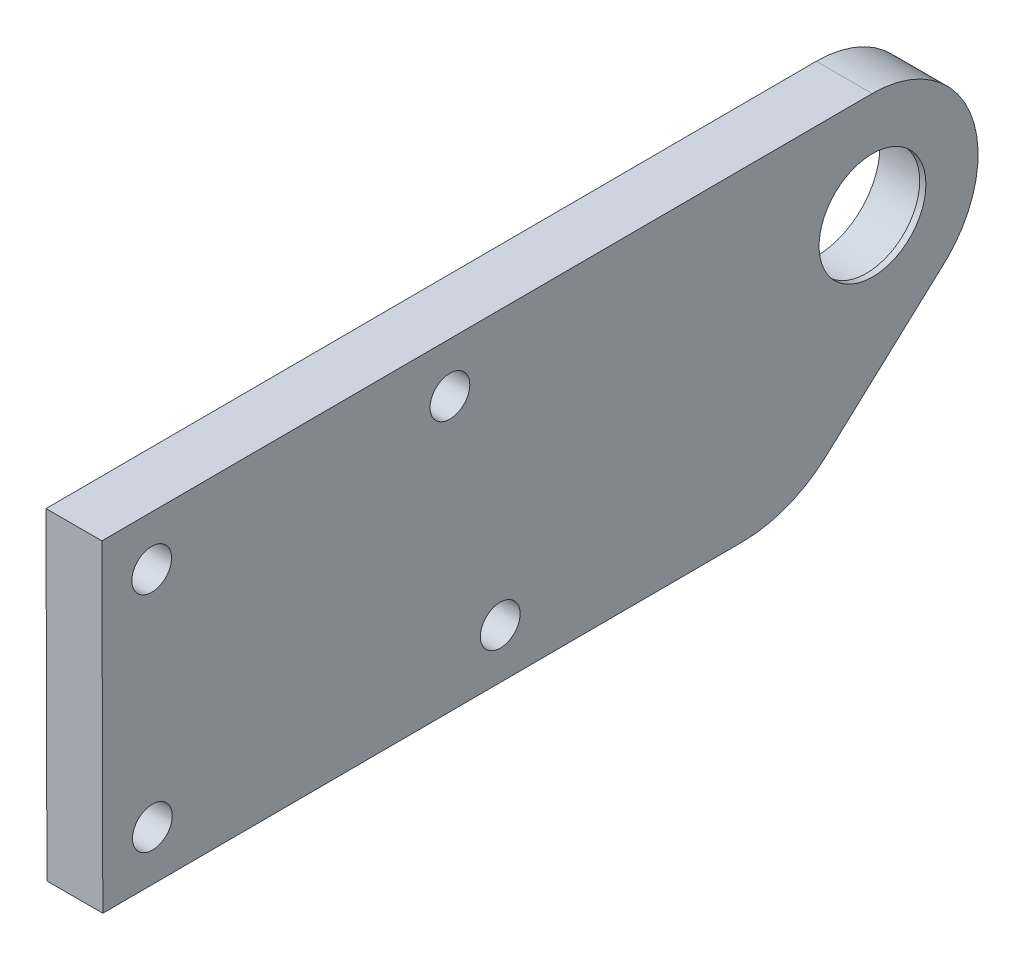
ISO-10303-21;
HEADER;
FILE_DESCRIPTION(('STEP AP214'),'2;1');
FILE_NAME('part.step','',(''),(''),'','','');
FILE_SCHEMA(('AUTOMOTIVE_DESIGN { 1 0 10303 214 1 1 1 1 }'));
ENDSEC;
DATA;
#1=APPLICATION_CONTEXT('core data for automotive mechanical design processes');
#2=APPLICATION_PROTOCOL_DEFINITION('international standard','automotive_design',2000,#1);
#3=PRODUCT_CONTEXT('',#1,'mechanical');
#4=PRODUCT('Part','Part','',(#3));
#5=PRODUCT_RELATED_PRODUCT_CATEGORY('part','',(#4));
#6=PRODUCT_DEFINITION_FORMATION('','',#4);
#7=PRODUCT_DEFINITION_CONTEXT('part definition',#1,'design');
#8=PRODUCT_DEFINITION('design','',#6,#7);
#9=PRODUCT_DEFINITION_SHAPE('','',#8);
#10=(LENGTH_UNIT() NAMED_UNIT(*) SI_UNIT(.MILLI.,.METRE.));
#11=(NAMED_UNIT(*) PLANE_ANGLE_UNIT() SI_UNIT($,.RADIAN.));
#12=(NAMED_UNIT(*) SI_UNIT($,.STERADIAN.) SOLID_ANGLE_UNIT());
#13=UNCERTAINTY_MEASURE_WITH_UNIT(LENGTH_MEASURE(1.E-05),#10,'distance_accuracy_value','');
#14=(GEOMETRIC_REPRESENTATION_CONTEXT(3) GLOBAL_UNCERTAINTY_ASSIGNED_CONTEXT((#13)) GLOBAL_UNIT_ASSIGNED_CONTEXT((#10,
#11,#12)) REPRESENTATION_CONTEXT('',''));
#15=CARTESIAN_POINT('',(0.,0.,0.));
#16=DIRECTION('',(0.,0.,1.));
#17=DIRECTION('',(1.,0.,0.));
#18=AXIS2_PLACEMENT_3D('',#15,#16,#17);
#19=CARTESIAN_POINT('',(4.5,-0.106760715950999,-0.0387879175810517));
#20=DIRECTION('',(1.,0.,0.));
#21=DIRECTION('',(0.,0.,-1.));
#22=AXIS2_PLACEMENT_3D('',#19,#20,#21);
#23=PLANE('',#22);
#24=CARTESIAN_POINT('',(4.5,-13.7733767562103,57.9221783097702));
#25=DIRECTION('',(1.,0.,0.));
#26=DIRECTION('',(0.,0.,-1.));
#27=AXIS2_PLACEMENT_3D('',#24,#25,#26);
#28=CIRCLE('',#27,1.59999999999998);
#29=CARTESIAN_POINT('',(4.5,-13.7733767562103,56.3221783097702));
#30=VERTEX_POINT('',#29);
#31=EDGE_CURVE('E212',#30,#30,#28,.T.);
#32=ORIENTED_EDGE('',*,*,#31,.F.);
#33=EDGE_LOOP('',(#32));
#34=FACE_BOUND('',#33,.T.);
#35=CARTESIAN_POINT('',(4.5,4.22654892278509,57.9739040349113));
#36=DIRECTION('',(1.,0.,0.));
#37=DIRECTION('',(0.,0.,-1.));
#38=AXIS2_PLACEMENT_3D('',#35,#36,#37);
#39=CIRCLE('',#38,1.60000000000002);
#40=CARTESIAN_POINT('',(4.5,4.22654892278509,56.3739040349113));
#41=VERTEX_POINT('',#40);
#42=EDGE_CURVE('E224',#41,#41,#39,.T.);
#43=ORIENTED_EDGE('',*,*,#42,.F.);
#44=EDGE_LOOP('',(#43));
#45=FACE_BOUND('',#44,.T.);
#46=DIRECTION('',(0.,-0.00287365139677191,0.999995871055301));
#47=VECTOR('',#46,1.);
#48=CARTESIAN_POINT('',(4.5,8.21503780141921,61.9853821247201));
#49=LINE('',#48,#47);
#50=CARTESIAN_POINT('',(4.5,8.39320418801906,-0.0143618807086011));
#51=VERTEX_POINT('',#50);
#52=CARTESIAN_POINT('',(4.5,8.21503780141921,61.9853821247201));
#53=VERTEX_POINT('',#52);
#54=EDGE_CURVE('E132',#51,#53,#49,.T.);
#55=ORIENTED_EDGE('',*,*,#54,.T.);
#56=DIRECTION('',(0.,-0.999995871055301,-0.00287365139675991));
#57=VECTOR('',#56,1.);
#58=CARTESIAN_POINT('',(4.5,8.21503780141921,61.9853821247201));
#59=LINE('',#58,#57);
#60=CARTESIAN_POINT('',(4.5,-17.7848548460186,61.9106671884043));
#61=VERTEX_POINT('',#60);
#62=EDGE_CURVE('E90',#53,#61,#59,.T.);
#63=ORIENTED_EDGE('',*,*,#62,.T.);
#64=DIRECTION('',(0.,0.002873651396772,-0.999995871055301));
#65=VECTOR('',#64,1.);
#66=CARTESIAN_POINT('',(4.5,-17.7848548460186,61.9106671884043));
#67=LINE('',#66,#65);
#68=CARTESIAN_POINT('',(4.5,-17.6368617990849,10.4108798290563));
#69=VERTEX_POINT('',#68);
#70=EDGE_CURVE('E103',#61,#69,#67,.T.);
#71=ORIENTED_EDGE('',*,*,#70,.T.);
#72=CARTESIAN_POINT('',(4.5,-7.63690308853195,10.439616343024));
#73=DIRECTION('',(1.,0.,0.));
#74=DIRECTION('',(0.,0.,-1.));
#75=AXIS2_PLACEMENT_3D('',#72,#73,#74);
#76=CIRCLE('',#75,9.99999999999991);
#77=CARTESIAN_POINT('',(4.5,-15.0193601103393,3.69429734973951));
#78=VERTEX_POINT('',#77);
#79=EDGE_CURVE('E97',#69,#78,#76,.T.);
#80=ORIENTED_EDGE('',*,*,#79,.T.);
#81=DIRECTION('',(0.,0.674531899328458,-0.738245702180746));
#82=VECTOR('',#81,1.);
#83=CARTESIAN_POINT('',(4.5,-15.0193601103393,3.6942973497395));
#84=LINE('',#83,#82);
#85=CARTESIAN_POINT('',(4.5,-6.11262214246682,-6.05373833512312));
#86=VERTEX_POINT('',#85);
#87=EDGE_CURVE('E101',#78,#86,#84,.T.);
#88=ORIENTED_EDGE('',*,*,#87,.T.);
#89=CARTESIAN_POINT('',(4.5,-0.106760715950999,-0.0387879175810517));
#90=DIRECTION('',(1.,0.,0.));
#91=DIRECTION('',(0.,0.,-1.));
#92=AXIS2_PLACEMENT_3D('',#89,#90,#91);
#93=CIRCLE('',#92,8.50000000000001);
#94=EDGE_CURVE('E53',#86,#51,#93,.T.);
#95=ORIENTED_EDGE('',*,*,#94,.T.);
#96=EDGE_LOOP('',(#55,#63,#71,#80,#88,#95));
#97=FACE_BOUND('',#96,.T.);
#98=CARTESIAN_POINT('',(4.5,-0.106760715950999,-0.0387879175810517));
#99=DIRECTION('',(1.,0.,0.));
#100=DIRECTION('',(0.,0.,-1.));
#101=AXIS2_PLACEMENT_3D('',#98,#99,#100);
#102=CIRCLE('',#101,4.3);
#103=CARTESIAN_POINT('',(4.5,-0.106760715950999,-4.33878791758105));
#104=VERTEX_POINT('',#103);
#105=EDGE_CURVE('E125',#104,#104,#102,.T.);
#106=ORIENTED_EDGE('',*,*,#105,.F.);
#107=EDGE_LOOP('',(#106));
#108=FACE_BOUND('',#107,.T.);
#109=CARTESIAN_POINT('',(4.5,4.29551655630707,33.9740031295841));
#110=DIRECTION('',(1.,0.,0.));
#111=DIRECTION('',(0.,0.,-1.));
#112=AXIS2_PLACEMENT_3D('',#109,#110,#111);
#113=CIRCLE('',#112,1.60000000000002);
#114=CARTESIAN_POINT('',(4.5,4.29551655630707,32.3740031295841));
#115=VERTEX_POINT('',#114);
#116=EDGE_CURVE('E218',#115,#115,#113,.T.);
#117=ORIENTED_EDGE('',*,*,#116,.F.);
#118=EDGE_LOOP('',(#117));
#119=FACE_BOUND('',#118,.T.);
#120=CARTESIAN_POINT('',(4.5,-13.6929145171007,29.9222939202218));
#121=DIRECTION('',(1.,0.,0.));
#122=DIRECTION('',(0.,0.,-1.));
#123=AXIS2_PLACEMENT_3D('',#120,#121,#122);
#124=CIRCLE('',#123,1.59999999999999);
#125=CARTESIAN_POINT('',(4.5,-13.6929145171007,28.3222939202218));
#126=VERTEX_POINT('',#125);
#127=EDGE_CURVE('E206',#126,#126,#124,.T.);
#128=ORIENTED_EDGE('',*,*,#127,.F.);
#129=EDGE_LOOP('',(#128));
#130=FACE_BOUND('',#129,.T.);
#131=ADVANCED_FACE('F35',(#34,#45,#97,#108,#119,#130),#23,.T.);
#132=CARTESIAN_POINT('',(0.,-0.106760715950999,-0.0387879175810517));
#133=DIRECTION('',(1.,0.,0.));
#134=DIRECTION('',(0.,0.,-1.));
#135=AXIS2_PLACEMENT_3D('',#132,#133,#134);
#136=PLANE('',#135);
#137=CARTESIAN_POINT('',(0.,-0.106760715950999,-0.0387879175810517));
#138=DIRECTION('',(1.,0.,0.));
#139=DIRECTION('',(0.,0.,-1.));
#140=AXIS2_PLACEMENT_3D('',#137,#138,#139);
#141=CIRCLE('',#140,5.1);
#142=CARTESIAN_POINT('',(0.,-0.106760715950999,-5.13878791758105));
#143=VERTEX_POINT('',#142);
#144=EDGE_CURVE('E200',#143,#143,#141,.T.);
#145=ORIENTED_EDGE('',*,*,#144,.T.);
#146=EDGE_LOOP('',(#145));
#147=FACE_BOUND('',#146,.T.);
#148=DIRECTION('',(0.,-0.00287365139677191,0.999995871055301));
#149=VECTOR('',#148,1.);
#150=CARTESIAN_POINT('',(0.,8.21503780141921,61.9853821247201));
#151=LINE('',#150,#149);
#152=CARTESIAN_POINT('',(0.,8.39320418801906,-0.0143618807086011));
#153=VERTEX_POINT('',#152);
#154=CARTESIAN_POINT('',(0.,8.21503780141921,61.9853821247201));
#155=VERTEX_POINT('',#154);
#156=EDGE_CURVE('E121',#153,#155,#151,.T.);
#157=ORIENTED_EDGE('',*,*,#156,.F.);
#158=CARTESIAN_POINT('',(0.,-0.106760715950999,-0.0387879175810517));
#159=DIRECTION('',(1.,0.,0.));
#160=DIRECTION('',(0.,0.,-1.));
#161=AXIS2_PLACEMENT_3D('',#158,#159,#160);
#162=CIRCLE('',#161,8.50000000000001);
#163=CARTESIAN_POINT('',(0.,-6.11262214246682,-6.05373833512312));
#164=VERTEX_POINT('',#163);
#165=EDGE_CURVE('E82',#164,#153,#162,.T.);
#166=ORIENTED_EDGE('',*,*,#165,.F.);
#167=DIRECTION('',(0.,0.674531899328458,-0.738245702180746));
#168=VECTOR('',#167,1.);
#169=CARTESIAN_POINT('',(0.,-15.0193601103393,3.6942973497395));
#170=LINE('',#169,#168);
#171=CARTESIAN_POINT('',(0.,-15.0193601103393,3.69429734973951));
#172=VERTEX_POINT('',#171);
#173=EDGE_CURVE('E76',#172,#164,#170,.T.);
#174=ORIENTED_EDGE('',*,*,#173,.F.);
#175=CARTESIAN_POINT('',(0.,-7.63690308853195,10.439616343024));
#176=DIRECTION('',(1.,0.,0.));
#177=DIRECTION('',(0.,0.,-1.));
#178=AXIS2_PLACEMENT_3D('',#175,#176,#177);
#179=CIRCLE('',#178,9.99999999999991);
#180=CARTESIAN_POINT('',(0.,-17.6368617990849,10.4108798290563));
#181=VERTEX_POINT('',#180);
#182=EDGE_CURVE('E111',#181,#172,#179,.T.);
#183=ORIENTED_EDGE('',*,*,#182,.F.);
#184=DIRECTION('',(0.,0.002873651396772,-0.999995871055301));
#185=VECTOR('',#184,1.);
#186=CARTESIAN_POINT('',(0.,-17.7848548460186,61.9106671884043));
#187=LINE('',#186,#185);
#188=CARTESIAN_POINT('',(0.,-17.7848548460186,61.9106671884043));
#189=VERTEX_POINT('',#188);
#190=EDGE_CURVE('E127',#189,#181,#187,.T.);
#191=ORIENTED_EDGE('',*,*,#190,.F.);
#192=DIRECTION('',(0.,-0.999995871055301,-0.00287365139675991));
#193=VECTOR('',#192,1.);
#194=CARTESIAN_POINT('',(0.,8.21503780141921,61.9853821247201));
#195=LINE('',#194,#193);
#196=EDGE_CURVE('E124',#155,#189,#195,.T.);
#197=ORIENTED_EDGE('',*,*,#196,.F.);
#198=EDGE_LOOP('',(#157,#166,#174,#183,#191,#197));
#199=FACE_BOUND('',#198,.T.);
#200=CARTESIAN_POINT('',(0.,4.22654892278509,57.9739040349113));
#201=DIRECTION('',(1.,0.,0.));
#202=DIRECTION('',(0.,0.,-1.));
#203=AXIS2_PLACEMENT_3D('',#200,#201,#202);
#204=CIRCLE('',#203,1.60000000000002);
#205=CARTESIAN_POINT('',(0.,4.22654892278509,56.3739040349113));
#206=VERTEX_POINT('',#205);
#207=EDGE_CURVE('E221',#206,#206,#204,.T.);
#208=ORIENTED_EDGE('',*,*,#207,.T.);
#209=EDGE_LOOP('',(#208));
#210=FACE_BOUND('',#209,.T.);
#211=CARTESIAN_POINT('',(0.,4.29551655630707,33.9740031295841));
#212=DIRECTION('',(1.,0.,0.));
#213=DIRECTION('',(0.,0.,-1.));
#214=AXIS2_PLACEMENT_3D('',#211,#212,#213);
#215=CIRCLE('',#214,1.60000000000002);
#216=CARTESIAN_POINT('',(0.,4.29551655630707,32.3740031295841));
#217=VERTEX_POINT('',#216);
#218=EDGE_CURVE('E215',#217,#217,#215,.T.);
#219=ORIENTED_EDGE('',*,*,#218,.T.);
#220=EDGE_LOOP('',(#219));
#221=FACE_BOUND('',#220,.T.);
#222=CARTESIAN_POINT('',(0.,-13.7733767562103,57.9221783097702));
#223=DIRECTION('',(1.,0.,0.));
#224=DIRECTION('',(0.,0.,-1.));
#225=AXIS2_PLACEMENT_3D('',#222,#223,#224);
#226=CIRCLE('',#225,1.59999999999998);
#227=CARTESIAN_POINT('',(0.,-13.7733767562103,56.3221783097702));
#228=VERTEX_POINT('',#227);
#229=EDGE_CURVE('E209',#228,#228,#226,.T.);
#230=ORIENTED_EDGE('',*,*,#229,.T.);
#231=EDGE_LOOP('',(#230));
#232=FACE_BOUND('',#231,.T.);
#233=CARTESIAN_POINT('',(0.,-13.6929145171007,29.9222939202218));
#234=DIRECTION('',(1.,0.,0.));
#235=DIRECTION('',(0.,0.,-1.));
#236=AXIS2_PLACEMENT_3D('',#233,#234,#235);
#237=CIRCLE('',#236,1.59999999999999);
#238=CARTESIAN_POINT('',(0.,-13.6929145171007,28.3222939202218));
#239=VERTEX_POINT('',#238);
#240=EDGE_CURVE('E202',#239,#239,#237,.T.);
#241=ORIENTED_EDGE('',*,*,#240,.T.);
#242=EDGE_LOOP('',(#241));
#243=FACE_BOUND('',#242,.T.);
#244=ADVANCED_FACE('F142',(#147,#199,#210,#221,#232,#243),#136,.F.);
#245=CARTESIAN_POINT('',(4.5,8.21503780141921,61.9853821247201));
#246=DIRECTION('',(0.,-0.999995871055301,-0.00287365139677191));
#247=DIRECTION('',(0.,0.00287365139677191,-0.999995871055301));
#248=AXIS2_PLACEMENT_3D('',#245,#246,#247);
#249=PLANE('',#248);
#250=ORIENTED_EDGE('',*,*,#156,.T.);
#251=DIRECTION('',(-1.,0.,0.));
#252=VECTOR('',#251,1.);
#253=CARTESIAN_POINT('',(4.5,8.21503780141921,61.9853821247201));
#254=LINE('',#253,#252);
#255=EDGE_CURVE('E11',#53,#155,#254,.T.);
#256=ORIENTED_EDGE('',*,*,#255,.F.);
#257=ORIENTED_EDGE('',*,*,#54,.F.);
#258=DIRECTION('',(-1.,0.,0.));
#259=VECTOR('',#258,1.);
#260=CARTESIAN_POINT('',(4.5,8.39320418801906,-0.0143618807086011));
#261=LINE('',#260,#259);
#262=EDGE_CURVE('E117',#51,#153,#261,.T.);
#263=ORIENTED_EDGE('',*,*,#262,.T.);
#264=EDGE_LOOP('',(#250,#256,#257,#263));
#265=FACE_BOUND('',#264,.T.);
#266=ADVANCED_FACE('F37',(#265),#249,.F.);
#267=CARTESIAN_POINT('',(4.5,8.21503780141921,61.9853821247201));
#268=DIRECTION('',(0.,0.00287365139675991,-0.999995871055301));
#269=DIRECTION('',(0.,0.999995871055301,0.00287365139675991));
#270=AXIS2_PLACEMENT_3D('',#267,#268,#269);
#271=PLANE('',#270);
#272=ORIENTED_EDGE('',*,*,#196,.T.);
#273=DIRECTION('',(-1.,0.,0.));
#274=VECTOR('',#273,1.);
#275=CARTESIAN_POINT('',(4.5,-17.7848548460186,61.9106671884043));
#276=LINE('',#275,#274);
#277=EDGE_CURVE('E45',#61,#189,#276,.T.);
#278=ORIENTED_EDGE('',*,*,#277,.F.);
#279=ORIENTED_EDGE('',*,*,#62,.F.);
#280=ORIENTED_EDGE('',*,*,#255,.T.);
#281=EDGE_LOOP('',(#272,#278,#279,#280));
#282=FACE_BOUND('',#281,.T.);
#283=ADVANCED_FACE('F293',(#282),#271,.F.);
#284=CARTESIAN_POINT('',(4.5,-17.7848548460186,61.9106671884043));
#285=DIRECTION('',(0.,0.999995871055301,0.002873651396772));
#286=DIRECTION('',(0.,-0.002873651396772,0.999995871055301));
#287=AXIS2_PLACEMENT_3D('',#284,#285,#286);
#288=PLANE('',#287);
#289=ORIENTED_EDGE('',*,*,#190,.T.);
#290=DIRECTION('',(-1.,0.,0.));
#291=VECTOR('',#290,1.);
#292=CARTESIAN_POINT('',(4.5,-17.6368617990849,10.4108798290563));
#293=LINE('',#292,#291);
#294=EDGE_CURVE('E112',#69,#181,#293,.T.);
#295=ORIENTED_EDGE('',*,*,#294,.F.);
#296=ORIENTED_EDGE('',*,*,#70,.F.);
#297=ORIENTED_EDGE('',*,*,#277,.T.);
#298=EDGE_LOOP('',(#289,#295,#296,#297));
#299=FACE_BOUND('',#298,.T.);
#300=ADVANCED_FACE('F139',(#299),#288,.F.);
#301=CARTESIAN_POINT('',(4.5,-7.63690308853195,10.439616343024));
#302=DIRECTION('',(-1.,0.,0.));
#303=DIRECTION('',(0.,0.,1.));
#304=AXIS2_PLACEMENT_3D('',#301,#302,#303);
#305=CYLINDRICAL_SURFACE('',#304,9.99999999999991);
#306=ORIENTED_EDGE('',*,*,#182,.T.);
#307=DIRECTION('',(-1.,0.,0.));
#308=VECTOR('',#307,1.);
#309=CARTESIAN_POINT('',(4.5,-15.0193601103393,3.69429734973951));
#310=LINE('',#309,#308);
#311=EDGE_CURVE('E108',#78,#172,#310,.T.);
#312=ORIENTED_EDGE('',*,*,#311,.F.);
#313=ORIENTED_EDGE('',*,*,#79,.F.);
#314=ORIENTED_EDGE('',*,*,#294,.T.);
#315=EDGE_LOOP('',(#306,#312,#313,#314));
#316=FACE_BOUND('',#315,.T.);
#317=ADVANCED_FACE('F109',(#316),#305,.T.);
#318=CARTESIAN_POINT('',(4.5,-15.0193601103393,3.6942973497395));
#319=DIRECTION('',(0.,0.738245702180746,0.674531899328458));
#320=DIRECTION('',(0.,-0.674531899328458,0.738245702180746));
#321=AXIS2_PLACEMENT_3D('',#318,#319,#320);
#322=PLANE('',#321);
#323=ORIENTED_EDGE('',*,*,#173,.T.);
#324=DIRECTION('',(-1.,0.,0.));
#325=VECTOR('',#324,1.);
#326=CARTESIAN_POINT('',(4.5,-6.11262214246682,-6.05373833512312));
#327=LINE('',#326,#325);
#328=EDGE_CURVE('E113',#86,#164,#327,.T.);
#329=ORIENTED_EDGE('',*,*,#328,.F.);
#330=ORIENTED_EDGE('',*,*,#87,.F.);
#331=ORIENTED_EDGE('',*,*,#311,.T.);
#332=EDGE_LOOP('',(#323,#329,#330,#331));
#333=FACE_BOUND('',#332,.T.);
#334=ADVANCED_FACE('F115',(#333),#322,.F.);
#335=CARTESIAN_POINT('',(4.5,-0.106760715950999,-0.0387879175810517));
#336=DIRECTION('',(-1.,0.,0.));
#337=DIRECTION('',(0.,0.,1.));
#338=AXIS2_PLACEMENT_3D('',#335,#336,#337);
#339=CYLINDRICAL_SURFACE('',#338,8.50000000000001);
#340=ORIENTED_EDGE('',*,*,#165,.T.);
#341=ORIENTED_EDGE('',*,*,#262,.F.);
#342=ORIENTED_EDGE('',*,*,#94,.F.);
#343=ORIENTED_EDGE('',*,*,#328,.T.);
#344=EDGE_LOOP('',(#340,#341,#342,#343));
#345=FACE_BOUND('',#344,.T.);
#346=ADVANCED_FACE('F147',(#345),#339,.T.);
#347=CARTESIAN_POINT('',(4.5,-0.106760715950999,-0.0387879175810517));
#348=DIRECTION('',(-1.,0.,0.));
#349=DIRECTION('',(0.,0.,1.));
#350=AXIS2_PLACEMENT_3D('',#347,#348,#349);
#351=CYLINDRICAL_SURFACE('',#350,4.3);
#352=CARTESIAN_POINT('',(4.,-0.106760715950999,-0.0387879175810517));
#353=DIRECTION('',(1.,0.,0.));
#354=DIRECTION('',(0.,0.,-1.));
#355=AXIS2_PLACEMENT_3D('',#352,#353,#354);
#356=CIRCLE('',#355,4.3);
#357=CARTESIAN_POINT('',(4.,-0.106760715950999,-4.33878791758105));
#358=VERTEX_POINT('',#357);
#359=EDGE_CURVE('E39',#358,#358,#356,.T.);
#360=ORIENTED_EDGE('',*,*,#359,.F.);
#361=EDGE_LOOP('',(#360));
#362=FACE_BOUND('',#361,.T.);
#363=ORIENTED_EDGE('',*,*,#105,.T.);
#364=EDGE_LOOP('',(#363));
#365=FACE_BOUND('',#364,.T.);
#366=ADVANCED_FACE('F149',(#362,#365),#351,.F.);
#367=CARTESIAN_POINT('',(4.5,4.22654892278509,57.9739040349113));
#368=DIRECTION('',(-1.,0.,0.));
#369=DIRECTION('',(0.,0.,1.));
#370=AXIS2_PLACEMENT_3D('',#367,#368,#369);
#371=CYLINDRICAL_SURFACE('',#370,1.60000000000002);
#372=ORIENTED_EDGE('',*,*,#42,.T.);
#373=EDGE_LOOP('',(#372));
#374=FACE_BOUND('',#373,.T.);
#375=ORIENTED_EDGE('',*,*,#207,.F.);
#376=EDGE_LOOP('',(#375));
#377=FACE_BOUND('',#376,.T.);
#378=ADVANCED_FACE('F155',(#374,#377),#371,.F.);
#379=CARTESIAN_POINT('',(4.5,4.29551655630707,33.9740031295841));
#380=DIRECTION('',(-1.,0.,0.));
#381=DIRECTION('',(0.,0.,1.));
#382=AXIS2_PLACEMENT_3D('',#379,#380,#381);
#383=CYLINDRICAL_SURFACE('',#382,1.60000000000002);
#384=ORIENTED_EDGE('',*,*,#116,.T.);
#385=EDGE_LOOP('',(#384));
#386=FACE_BOUND('',#385,.T.);
#387=ORIENTED_EDGE('',*,*,#218,.F.);
#388=EDGE_LOOP('',(#387));
#389=FACE_BOUND('',#388,.T.);
#390=ADVANCED_FACE('F172',(#386,#389),#383,.F.);
#391=CARTESIAN_POINT('',(4.5,-13.7733767562103,57.9221783097702));
#392=DIRECTION('',(-1.,0.,0.));
#393=DIRECTION('',(0.,0.,1.));
#394=AXIS2_PLACEMENT_3D('',#391,#392,#393);
#395=CYLINDRICAL_SURFACE('',#394,1.59999999999998);
#396=ORIENTED_EDGE('',*,*,#31,.T.);
#397=EDGE_LOOP('',(#396));
#398=FACE_BOUND('',#397,.T.);
#399=ORIENTED_EDGE('',*,*,#229,.F.);
#400=EDGE_LOOP('',(#399));
#401=FACE_BOUND('',#400,.T.);
#402=ADVANCED_FACE('F176',(#398,#401),#395,.F.);
#403=CARTESIAN_POINT('',(4.5,-13.6929145171007,29.9222939202218));
#404=DIRECTION('',(-1.,0.,0.));
#405=DIRECTION('',(0.,0.,1.));
#406=AXIS2_PLACEMENT_3D('',#403,#404,#405);
#407=CYLINDRICAL_SURFACE('',#406,1.59999999999999);
#408=ORIENTED_EDGE('',*,*,#127,.T.);
#409=EDGE_LOOP('',(#408));
#410=FACE_BOUND('',#409,.T.);
#411=ORIENTED_EDGE('',*,*,#240,.F.);
#412=EDGE_LOOP('',(#411));
#413=FACE_BOUND('',#412,.T.);
#414=ADVANCED_FACE('F180',(#410,#413),#407,.F.);
#415=CARTESIAN_POINT('',(4.,-0.106760715950999,-0.0387879175810517));
#416=DIRECTION('',(-1.,0.,0.));
#417=DIRECTION('',(0.,0.,1.));
#418=AXIS2_PLACEMENT_3D('',#415,#416,#417);
#419=CYLINDRICAL_SURFACE('',#418,5.1);
#420=CARTESIAN_POINT('',(4.,-0.106760715950999,-0.0387879175810517));
#421=DIRECTION('',(1.,0.,0.));
#422=DIRECTION('',(0.,0.,-1.));
#423=AXIS2_PLACEMENT_3D('',#420,#421,#422);
#424=CIRCLE('',#423,5.1);
#425=CARTESIAN_POINT('',(4.,-0.106760715950999,-5.13878791758105));
#426=VERTEX_POINT('',#425);
#427=EDGE_CURVE('E199',#426,#426,#424,.T.);
#428=ORIENTED_EDGE('',*,*,#427,.T.);
#429=EDGE_LOOP('',(#428));
#430=FACE_BOUND('',#429,.T.);
#431=ORIENTED_EDGE('',*,*,#144,.F.);
#432=EDGE_LOOP('',(#431));
#433=FACE_BOUND('',#432,.T.);
#434=ADVANCED_FACE('F184',(#430,#433),#419,.F.);
#435=CARTESIAN_POINT('',(4.,-0.106760715950999,-0.0387879175810517));
#436=DIRECTION('',(1.,0.,0.));
#437=DIRECTION('',(0.,0.,-1.));
#438=AXIS2_PLACEMENT_3D('',#435,#436,#437);
#439=PLANE('',#438);
#440=ORIENTED_EDGE('',*,*,#359,.T.);
#441=EDGE_LOOP('',(#440));
#442=FACE_BOUND('',#441,.T.);
#443=ORIENTED_EDGE('',*,*,#427,.F.);
#444=EDGE_LOOP('',(#443));
#445=FACE_BOUND('',#444,.T.);
#446=ADVANCED_FACE('F188',(#442,#445),#439,.F.);
#447=CLOSED_SHELL('',(#131,#244,#266,#283,#300,#317,#334,#346,#366,#378,#390,#402,#414,#434,#446));
#448=MANIFOLD_SOLID_BREP('B2',#447);
#449=ADVANCED_BREP_SHAPE_REPRESENTATION('',(#18,#448),#14);
#450=SHAPE_DEFINITION_REPRESENTATION(#9,#449);
ENDSEC;
END-ISO-10303-21;
